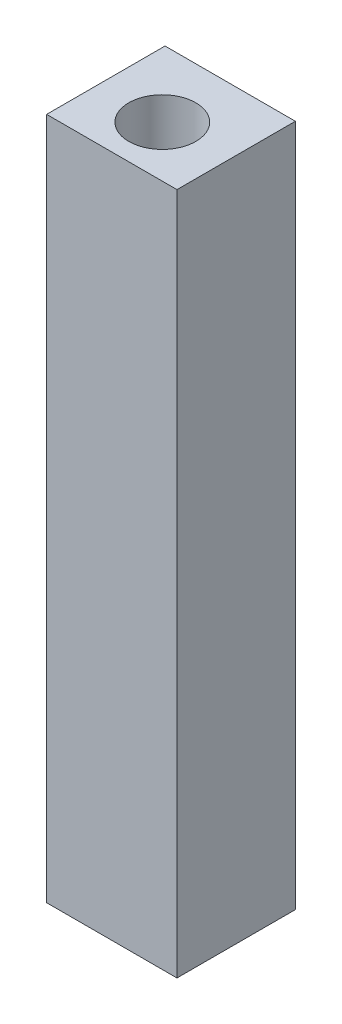
ISO-10303-21;
HEADER;
FILE_DESCRIPTION(('STEP AP214'),'2;1');
FILE_NAME('part.step','',(''),(''),'','','');
FILE_SCHEMA(('AUTOMOTIVE_DESIGN { 1 0 10303 214 1 1 1 1 }'));
ENDSEC;
DATA;
#1=APPLICATION_CONTEXT('core data for automotive mechanical design processes');
#2=APPLICATION_PROTOCOL_DEFINITION('international standard','automotive_design',2000,#1);
#3=PRODUCT_CONTEXT('',#1,'mechanical');
#4=PRODUCT('Part','Part','',(#3));
#5=PRODUCT_RELATED_PRODUCT_CATEGORY('part','',(#4));
#6=PRODUCT_DEFINITION_FORMATION('','',#4);
#7=PRODUCT_DEFINITION_CONTEXT('part definition',#1,'design');
#8=PRODUCT_DEFINITION('design','',#6,#7);
#9=PRODUCT_DEFINITION_SHAPE('','',#8);
#10=(LENGTH_UNIT() NAMED_UNIT(*) SI_UNIT(.MILLI.,.METRE.));
#11=(NAMED_UNIT(*) PLANE_ANGLE_UNIT() SI_UNIT($,.RADIAN.));
#12=(NAMED_UNIT(*) SI_UNIT($,.STERADIAN.) SOLID_ANGLE_UNIT());
#13=UNCERTAINTY_MEASURE_WITH_UNIT(LENGTH_MEASURE(1.E-05),#10,'distance_accuracy_value','');
#14=(GEOMETRIC_REPRESENTATION_CONTEXT(3) GLOBAL_UNCERTAINTY_ASSIGNED_CONTEXT((#13)) GLOBAL_UNIT_ASSIGNED_CONTEXT((#10,
#11,#12)) REPRESENTATION_CONTEXT('',''));
#15=CARTESIAN_POINT('',(0.,0.,0.));
#16=DIRECTION('',(0.,0.,1.));
#17=DIRECTION('',(1.,0.,0.));
#18=AXIS2_PLACEMENT_3D('',#15,#16,#17);
#19=CARTESIAN_POINT('',(-25.4065395585399,100.,-17.3409714447178));
#20=DIRECTION('',(1.,0.,0.));
#21=DIRECTION('',(0.,0.,-1.));
#22=AXIS2_PLACEMENT_3D('',#19,#20,#21);
#23=PLANE('',#22);
#24=DIRECTION('',(0.,0.,1.));
#25=VECTOR('',#24,1.);
#26=CARTESIAN_POINT('',(-25.4065395585399,0.,-17.3409714447178));
#27=LINE('',#26,#25);
#28=CARTESIAN_POINT('',(-25.4065395585399,0.,-17.3409714447178));
#29=VERTEX_POINT('',#28);
#30=CARTESIAN_POINT('',(-25.4065395585399,0.,0.));
#31=VERTEX_POINT('',#30);
#32=EDGE_CURVE('E98',#29,#31,#27,.T.);
#33=ORIENTED_EDGE('',*,*,#32,.T.);
#34=DIRECTION('',(0.,-1.,0.));
#35=VECTOR('',#34,1.);
#36=CARTESIAN_POINT('',(-25.4065395585399,100.,0.));
#37=LINE('',#36,#35);
#38=CARTESIAN_POINT('',(-25.4065395585399,100.,0.));
#39=VERTEX_POINT('',#38);
#40=EDGE_CURVE('E11',#39,#31,#37,.T.);
#41=ORIENTED_EDGE('',*,*,#40,.F.);
#42=DIRECTION('',(0.,0.,1.));
#43=VECTOR('',#42,1.);
#44=CARTESIAN_POINT('',(-25.4065395585399,100.,-17.3409714447178));
#45=LINE('',#44,#43);
#46=CARTESIAN_POINT('',(-25.4065395585399,100.,-17.3409714447178));
#47=VERTEX_POINT('',#46);
#48=EDGE_CURVE('E86',#47,#39,#45,.T.);
#49=ORIENTED_EDGE('',*,*,#48,.F.);
#50=DIRECTION('',(0.,-1.,0.));
#51=VECTOR('',#50,1.);
#52=CARTESIAN_POINT('',(-25.4065395585399,100.,-17.3409714447178));
#53=LINE('',#52,#51);
#54=EDGE_CURVE('E94',#47,#29,#53,.T.);
#55=ORIENTED_EDGE('',*,*,#54,.T.);
#56=EDGE_LOOP('',(#33,#41,#49,#55));
#57=FACE_BOUND('',#56,.T.);
#58=ADVANCED_FACE('F35',(#57),#23,.F.);
#59=CARTESIAN_POINT('',(-25.4065395585399,100.,0.));
#60=DIRECTION('',(0.,0.,-1.));
#61=DIRECTION('',(-1.,0.,0.));
#62=AXIS2_PLACEMENT_3D('',#59,#60,#61);
#63=PLANE('',#62);
#64=DIRECTION('',(1.,0.,0.));
#65=VECTOR('',#64,1.);
#66=CARTESIAN_POINT('',(-25.4065395585399,0.,0.));
#67=LINE('',#66,#65);
#68=CARTESIAN_POINT('',(-6.3180283558274,0.,0.));
#69=VERTEX_POINT('',#68);
#70=EDGE_CURVE('E90',#31,#69,#67,.T.);
#71=ORIENTED_EDGE('',*,*,#70,.T.);
#72=DIRECTION('',(0.,-1.,0.));
#73=VECTOR('',#72,1.);
#74=CARTESIAN_POINT('',(-6.3180283558274,100.,0.));
#75=LINE('',#74,#73);
#76=CARTESIAN_POINT('',(-6.3180283558274,100.,0.));
#77=VERTEX_POINT('',#76);
#78=EDGE_CURVE('E43',#77,#69,#75,.T.);
#79=ORIENTED_EDGE('',*,*,#78,.F.);
#80=DIRECTION('',(1.,0.,0.));
#81=VECTOR('',#80,1.);
#82=CARTESIAN_POINT('',(-25.4065395585399,100.,0.));
#83=LINE('',#82,#81);
#84=EDGE_CURVE('E81',#39,#77,#83,.T.);
#85=ORIENTED_EDGE('',*,*,#84,.F.);
#86=ORIENTED_EDGE('',*,*,#40,.T.);
#87=EDGE_LOOP('',(#71,#79,#85,#86));
#88=FACE_BOUND('',#87,.T.);
#89=ADVANCED_FACE('F89',(#88),#63,.F.);
#90=CARTESIAN_POINT('',(-6.3180283558274,100.,-17.3409714447178));
#91=DIRECTION('',(-1.,0.,0.));
#92=DIRECTION('',(0.,0.,1.));
#93=AXIS2_PLACEMENT_3D('',#90,#91,#92);
#94=PLANE('',#93);
#95=DIRECTION('',(0.,0.,-1.));
#96=VECTOR('',#95,1.);
#97=CARTESIAN_POINT('',(-6.3180283558274,0.,-17.3409714447178));
#98=LINE('',#97,#96);
#99=CARTESIAN_POINT('',(-6.3180283558274,0.,-17.3409714447178));
#100=VERTEX_POINT('',#99);
#101=EDGE_CURVE('E68',#69,#100,#98,.T.);
#102=ORIENTED_EDGE('',*,*,#101,.T.);
#103=DIRECTION('',(0.,-1.,0.));
#104=VECTOR('',#103,1.);
#105=CARTESIAN_POINT('',(-6.3180283558274,100.,-17.3409714447178));
#106=LINE('',#105,#104);
#107=CARTESIAN_POINT('',(-6.3180283558274,100.,-17.3409714447178));
#108=VERTEX_POINT('',#107);
#109=EDGE_CURVE('E91',#108,#100,#106,.T.);
#110=ORIENTED_EDGE('',*,*,#109,.F.);
#111=DIRECTION('',(0.,0.,-1.));
#112=VECTOR('',#111,1.);
#113=CARTESIAN_POINT('',(-6.3180283558274,100.,-17.3409714447178));
#114=LINE('',#113,#112);
#115=EDGE_CURVE('E84',#77,#108,#114,.T.);
#116=ORIENTED_EDGE('',*,*,#115,.F.);
#117=ORIENTED_EDGE('',*,*,#78,.T.);
#118=EDGE_LOOP('',(#102,#110,#116,#117));
#119=FACE_BOUND('',#118,.T.);
#120=ADVANCED_FACE('F92',(#119),#94,.F.);
#121=CARTESIAN_POINT('',(-25.4065395585399,100.,-17.3409714447178));
#122=DIRECTION('',(0.,0.,1.));
#123=DIRECTION('',(1.,0.,0.));
#124=AXIS2_PLACEMENT_3D('',#121,#122,#123);
#125=PLANE('',#124);
#126=DIRECTION('',(-1.,0.,0.));
#127=VECTOR('',#126,1.);
#128=CARTESIAN_POINT('',(-25.4065395585399,0.,-17.3409714447178));
#129=LINE('',#128,#127);
#130=EDGE_CURVE('E74',#100,#29,#129,.T.);
#131=ORIENTED_EDGE('',*,*,#130,.T.);
#132=ORIENTED_EDGE('',*,*,#54,.F.);
#133=DIRECTION('',(-1.,0.,0.));
#134=VECTOR('',#133,1.);
#135=CARTESIAN_POINT('',(-25.4065395585399,100.,-17.3409714447178));
#136=LINE('',#135,#134);
#137=EDGE_CURVE('E51',#108,#47,#136,.T.);
#138=ORIENTED_EDGE('',*,*,#137,.F.);
#139=ORIENTED_EDGE('',*,*,#109,.T.);
#140=EDGE_LOOP('',(#131,#132,#138,#139));
#141=FACE_BOUND('',#140,.T.);
#142=ADVANCED_FACE('F106',(#141),#125,.F.);
#143=CARTESIAN_POINT('',(0.,100.,0.));
#144=DIRECTION('',(0.,1.,0.));
#145=DIRECTION('',(0.,0.,1.));
#146=AXIS2_PLACEMENT_3D('',#143,#144,#145);
#147=PLANE('',#146);
#148=CARTESIAN_POINT('',(-15.9539532644999,100.,-7.48628795849982));
#149=DIRECTION('',(0.,1.,0.));
#150=DIRECTION('',(0.,0.,1.));
#151=AXIS2_PLACEMENT_3D('',#148,#149,#150);
#152=CIRCLE('',#151,4.90961673526068);
#153=CARTESIAN_POINT('',(-15.9539532644999,100.,-2.57667122323914));
#154=VERTEX_POINT('',#153);
#155=EDGE_CURVE('E112',#154,#154,#152,.T.);
#156=ORIENTED_EDGE('',*,*,#155,.F.);
#157=EDGE_LOOP('',(#156));
#158=FACE_BOUND('',#157,.T.);
#159=ORIENTED_EDGE('',*,*,#48,.T.);
#160=ORIENTED_EDGE('',*,*,#84,.T.);
#161=ORIENTED_EDGE('',*,*,#115,.T.);
#162=ORIENTED_EDGE('',*,*,#137,.T.);
#163=EDGE_LOOP('',(#159,#160,#161,#162));
#164=FACE_BOUND('',#163,.T.);
#165=ADVANCED_FACE('F82',(#158,#164),#147,.T.);
#166=CARTESIAN_POINT('',(0.,0.,0.));
#167=DIRECTION('',(0.,1.,0.));
#168=DIRECTION('',(0.,0.,1.));
#169=AXIS2_PLACEMENT_3D('',#166,#167,#168);
#170=PLANE('',#169);
#171=ORIENTED_EDGE('',*,*,#32,.F.);
#172=ORIENTED_EDGE('',*,*,#130,.F.);
#173=ORIENTED_EDGE('',*,*,#101,.F.);
#174=ORIENTED_EDGE('',*,*,#70,.F.);
#175=EDGE_LOOP('',(#171,#172,#173,#174));
#176=FACE_BOUND('',#175,.T.);
#177=ADVANCED_FACE('F109',(#176),#170,.F.);
#178=CARTESIAN_POINT('',(-15.9539532644999,90.,-7.48628795849982));
#179=DIRECTION('',(0.,1.,0.));
#180=DIRECTION('',(0.,0.,1.));
#181=AXIS2_PLACEMENT_3D('',#178,#179,#180);
#182=CYLINDRICAL_SURFACE('',#181,4.90961673526068);
#183=CARTESIAN_POINT('',(-15.9539532644999,90.,-7.48628795849982));
#184=DIRECTION('',(0.,1.,0.));
#185=DIRECTION('',(0.,0.,1.));
#186=AXIS2_PLACEMENT_3D('',#183,#184,#185);
#187=CIRCLE('',#186,4.90961673526068);
#188=CARTESIAN_POINT('',(-15.9539532644999,90.,-2.57667122323914));
#189=VERTEX_POINT('',#188);
#190=EDGE_CURVE('E101',#189,#189,#187,.T.);
#191=ORIENTED_EDGE('',*,*,#190,.F.);
#192=EDGE_LOOP('',(#191));
#193=FACE_BOUND('',#192,.T.);
#194=ORIENTED_EDGE('',*,*,#155,.T.);
#195=EDGE_LOOP('',(#194));
#196=FACE_BOUND('',#195,.T.);
#197=ADVANCED_FACE('F120',(#193,#196),#182,.F.);
#198=CARTESIAN_POINT('',(-15.9539532644999,90.,-7.48628795849982));
#199=DIRECTION('',(0.,1.,0.));
#200=DIRECTION('',(0.,0.,1.));
#201=AXIS2_PLACEMENT_3D('',#198,#199,#200);
#202=PLANE('',#201);
#203=ORIENTED_EDGE('',*,*,#190,.T.);
#204=EDGE_LOOP('',(#203));
#205=FACE_BOUND('',#204,.T.);
#206=ADVANCED_FACE('F118',(#205),#202,.T.);
#207=CLOSED_SHELL('',(#58,#89,#120,#142,#165,#177,#197,#206));
#208=MANIFOLD_SOLID_BREP('B2',#207);
#209=ADVANCED_BREP_SHAPE_REPRESENTATION('',(#18,#208),#14);
#210=SHAPE_DEFINITION_REPRESENTATION(#9,#209);
ENDSEC;
END-ISO-10303-21;
